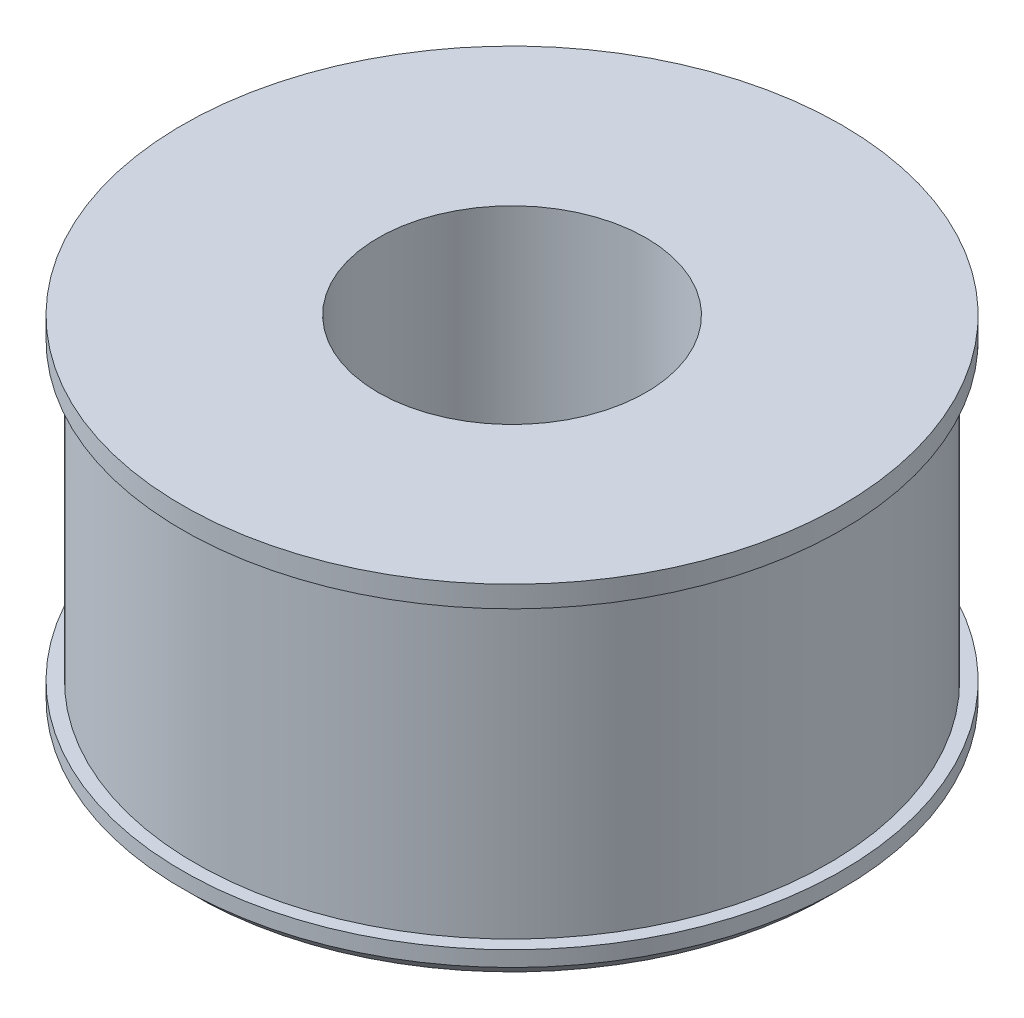
ISO-10303-21;
HEADER;
FILE_DESCRIPTION(('STEP AP214'),'2;1');
FILE_NAME('part.step','',(''),(''),'','','');
FILE_SCHEMA(('AUTOMOTIVE_DESIGN { 1 0 10303 214 1 1 1 1 }'));
ENDSEC;
DATA;
#1=APPLICATION_CONTEXT('core data for automotive mechanical design processes');
#2=APPLICATION_PROTOCOL_DEFINITION('international standard','automotive_design',2000,#1);
#3=PRODUCT_CONTEXT('',#1,'mechanical');
#4=PRODUCT('Part','Part','',(#3));
#5=PRODUCT_RELATED_PRODUCT_CATEGORY('part','',(#4));
#6=PRODUCT_DEFINITION_FORMATION('','',#4);
#7=PRODUCT_DEFINITION_CONTEXT('part definition',#1,'design');
#8=PRODUCT_DEFINITION('design','',#6,#7);
#9=PRODUCT_DEFINITION_SHAPE('','',#8);
#10=(LENGTH_UNIT() NAMED_UNIT(*) SI_UNIT(.MILLI.,.METRE.));
#11=(NAMED_UNIT(*) PLANE_ANGLE_UNIT() SI_UNIT($,.RADIAN.));
#12=(NAMED_UNIT(*) SI_UNIT($,.STERADIAN.) SOLID_ANGLE_UNIT());
#13=UNCERTAINTY_MEASURE_WITH_UNIT(LENGTH_MEASURE(1.E-05),#10,'distance_accuracy_value','');
#14=(GEOMETRIC_REPRESENTATION_CONTEXT(3) GLOBAL_UNCERTAINTY_ASSIGNED_CONTEXT((#13)) GLOBAL_UNIT_ASSIGNED_CONTEXT((#10,
#11,#12)) REPRESENTATION_CONTEXT('',''));
#15=CARTESIAN_POINT('',(0.,0.,0.));
#16=DIRECTION('',(0.,0.,1.));
#17=DIRECTION('',(1.,0.,0.));
#18=AXIS2_PLACEMENT_3D('',#15,#16,#17);
#19=CARTESIAN_POINT('',(0.,67.9541672598878,-133.507127196105));
#20=DIRECTION('',(0.,1.,0.));
#21=DIRECTION('',(0.,0.,1.));
#22=AXIS2_PLACEMENT_3D('',#19,#20,#21);
#23=PLANE('',#22);
#24=CARTESIAN_POINT('',(0.,67.9541672598878,0.));
#25=DIRECTION('',(0.,-1.,0.));
#26=DIRECTION('',(0.,0.,-1.));
#27=AXIS2_PLACEMENT_3D('',#24,#25,#26);
#28=CIRCLE('',#27,54.2672855149634);
#29=CARTESIAN_POINT('',(0.,67.9541672598878,-54.2672855149634));
#30=VERTEX_POINT('',#29);
#31=EDGE_CURVE('E69',#30,#30,#28,.T.);
#32=ORIENTED_EDGE('',*,*,#31,.T.);
#33=EDGE_LOOP('',(#32));
#34=FACE_BOUND('',#33,.T.);
#35=CARTESIAN_POINT('',(0.,67.9541672598878,0.));
#36=DIRECTION('',(0.,-1.,0.));
#37=DIRECTION('',(0.,0.,-1.));
#38=AXIS2_PLACEMENT_3D('',#35,#36,#37);
#39=CIRCLE('',#38,133.507127196105);
#40=CARTESIAN_POINT('',(0.,67.9541672598878,-133.507127196105));
#41=VERTEX_POINT('',#40);
#42=EDGE_CURVE('E64',#41,#41,#39,.T.);
#43=ORIENTED_EDGE('',*,*,#42,.F.);
#44=EDGE_LOOP('',(#43));
#45=FACE_BOUND('',#44,.T.);
#46=ADVANCED_FACE('F31',(#34,#45),#23,.T.);
#47=CARTESIAN_POINT('',(0.,-66.5134428656852,0.));
#48=DIRECTION('',(0.,-1.,0.));
#49=DIRECTION('',(0.,0.,-1.));
#50=AXIS2_PLACEMENT_3D('',#47,#48,#49);
#51=CYLINDRICAL_SURFACE('',#50,54.2672855149634);
#52=CARTESIAN_POINT('',(0.,-66.5134428656852,0.));
#53=DIRECTION('',(0.,-1.,0.));
#54=DIRECTION('',(0.,0.,-1.));
#55=AXIS2_PLACEMENT_3D('',#52,#53,#54);
#56=CIRCLE('',#55,54.2672855149634);
#57=CARTESIAN_POINT('',(0.,-66.5134428656852,-54.2672855149634));
#58=VERTEX_POINT('',#57);
#59=EDGE_CURVE('E44',#58,#58,#56,.T.);
#60=ORIENTED_EDGE('',*,*,#59,.T.);
#61=EDGE_LOOP('',(#60));
#62=FACE_BOUND('',#61,.T.);
#63=ORIENTED_EDGE('',*,*,#31,.F.);
#64=EDGE_LOOP('',(#63));
#65=FACE_BOUND('',#64,.T.);
#66=ADVANCED_FACE('F74',(#62,#65),#51,.F.);
#67=CARTESIAN_POINT('',(0.,-66.5134428656852,-54.2672855149634));
#68=DIRECTION('',(0.,-1.,0.));
#69=DIRECTION('',(0.,0.,-1.));
#70=AXIS2_PLACEMENT_3D('',#67,#68,#69);
#71=PLANE('',#70);
#72=CARTESIAN_POINT('',(0.,-66.5134428656852,0.));
#73=DIRECTION('',(0.,-1.,0.));
#74=DIRECTION('',(0.,0.,-1.));
#75=AXIS2_PLACEMENT_3D('',#72,#73,#74);
#76=CIRCLE('',#75,128.224471084029);
#77=CARTESIAN_POINT('',(0.,-66.5134428656852,-128.224471084029));
#78=VERTEX_POINT('',#77);
#79=EDGE_CURVE('E39',#78,#78,#76,.T.);
#80=ORIENTED_EDGE('',*,*,#79,.T.);
#81=EDGE_LOOP('',(#80));
#82=FACE_BOUND('',#81,.T.);
#83=ORIENTED_EDGE('',*,*,#59,.F.);
#84=EDGE_LOOP('',(#83));
#85=FACE_BOUND('',#84,.T.);
#86=ADVANCED_FACE('F77',(#82,#85),#71,.T.);
#87=CARTESIAN_POINT('',(0.,-66.5134428656852,0.));
#88=DIRECTION('',(0.,-1.,0.));
#89=DIRECTION('',(0.,0.,-1.));
#90=AXIS2_PLACEMENT_3D('',#87,#88,#89);
#91=CYLINDRICAL_SURFACE('',#90,133.507127196105);
#92=ORIENTED_EDGE('',*,*,#42,.T.);
#93=EDGE_LOOP('',(#92));
#94=FACE_BOUND('',#93,.T.);
#95=CARTESIAN_POINT('',(0.,59.3098208946724,0.));
#96=DIRECTION('',(0.,-1.,0.));
#97=DIRECTION('',(0.,0.,-1.));
#98=AXIS2_PLACEMENT_3D('',#95,#96,#97);
#99=CIRCLE('',#98,133.507127196105);
#100=CARTESIAN_POINT('',(0.,59.3098208946724,-133.507127196105));
#101=VERTEX_POINT('',#100);
#102=EDGE_CURVE('E59',#101,#101,#99,.T.);
#103=ORIENTED_EDGE('',*,*,#102,.F.);
#104=EDGE_LOOP('',(#103));
#105=FACE_BOUND('',#104,.T.);
#106=ADVANCED_FACE('F79',(#94,#105),#91,.T.);
#107=CARTESIAN_POINT('',(0.,59.3098208946724,-128.224471084029));
#108=DIRECTION('',(0.,-1.,0.));
#109=DIRECTION('',(0.,0.,-1.));
#110=AXIS2_PLACEMENT_3D('',#107,#108,#109);
#111=PLANE('',#110);
#112=ORIENTED_EDGE('',*,*,#102,.T.);
#113=EDGE_LOOP('',(#112));
#114=FACE_BOUND('',#113,.T.);
#115=CARTESIAN_POINT('',(0.,59.3098208946724,0.));
#116=DIRECTION('',(0.,-1.,0.));
#117=DIRECTION('',(0.,0.,-1.));
#118=AXIS2_PLACEMENT_3D('',#115,#116,#117);
#119=CIRCLE('',#118,128.224471084029);
#120=CARTESIAN_POINT('',(0.,59.3098208946724,-128.224471084029));
#121=VERTEX_POINT('',#120);
#122=EDGE_CURVE('E55',#121,#121,#119,.T.);
#123=ORIENTED_EDGE('',*,*,#122,.F.);
#124=EDGE_LOOP('',(#123));
#125=FACE_BOUND('',#124,.T.);
#126=ADVANCED_FACE('F86',(#114,#125),#111,.T.);
#127=CARTESIAN_POINT('',(0.,-66.5134428656852,0.));
#128=DIRECTION('',(0.,-1.,0.));
#129=DIRECTION('',(0.,0.,-1.));
#130=AXIS2_PLACEMENT_3D('',#127,#128,#129);
#131=CYLINDRICAL_SURFACE('',#130,128.224471084029);
#132=ORIENTED_EDGE('',*,*,#122,.T.);
#133=EDGE_LOOP('',(#132));
#134=FACE_BOUND('',#133,.T.);
#135=CARTESIAN_POINT('',(0.,-60.2703038241408,0.));
#136=DIRECTION('',(0.,-1.,0.));
#137=DIRECTION('',(0.,0.,-1.));
#138=AXIS2_PLACEMENT_3D('',#135,#136,#137);
#139=CIRCLE('',#138,128.224471084029);
#140=CARTESIAN_POINT('',(0.,-60.2703038241408,-128.224471084029));
#141=VERTEX_POINT('',#140);
#142=EDGE_CURVE('E10',#141,#141,#139,.F.);
#143=ORIENTED_EDGE('',*,*,#142,.T.);
#144=EDGE_LOOP('',(#143));
#145=FACE_BOUND('',#144,.T.);
#146=ADVANCED_FACE('F100',(#134,#145),#131,.T.);
#147=CARTESIAN_POINT('',(0.,-66.5134428656852,0.));
#148=DIRECTION('',(0.,1.,0.));
#149=DIRECTION('',(0.,0.,1.));
#150=AXIS2_PLACEMENT_3D('',#147,#148,#149);
#151=CONICAL_SURFACE('',#150,133.507127196105,0.785398163397422);
#152=CARTESIAN_POINT('',(0.,-71.7960989777615,0.));
#153=DIRECTION('',(0.,-1.,0.));
#154=DIRECTION('',(0.,0.,-1.));
#155=AXIS2_PLACEMENT_3D('',#152,#153,#154);
#156=CIRCLE('',#155,128.224471084029);
#157=CARTESIAN_POINT('',(0.,-71.7960989777615,-128.224471084029));
#158=VERTEX_POINT('',#157);
#159=EDGE_CURVE('E48',#158,#158,#156,.T.);
#160=ORIENTED_EDGE('',*,*,#159,.F.);
#161=EDGE_LOOP('',(#160));
#162=FACE_BOUND('',#161,.T.);
#163=CARTESIAN_POINT('',(0.,-66.5134428656852,0.));
#164=DIRECTION('',(0.,-1.,0.));
#165=DIRECTION('',(0.,0.,-1.));
#166=AXIS2_PLACEMENT_3D('',#163,#164,#165);
#167=CIRCLE('',#166,133.507127196105);
#168=CARTESIAN_POINT('',(0.,-66.5134428656852,-133.507127196105));
#169=VERTEX_POINT('',#168);
#170=EDGE_CURVE('E50',#169,#169,#167,.T.);
#171=ORIENTED_EDGE('',*,*,#170,.T.);
#172=EDGE_LOOP('',(#171));
#173=FACE_BOUND('',#172,.T.);
#174=ADVANCED_FACE('F103',(#162,#173),#151,.T.);
#175=CARTESIAN_POINT('',(0.,-66.5134428656852,0.));
#176=DIRECTION('',(0.,-1.,0.));
#177=DIRECTION('',(0.,0.,-1.));
#178=AXIS2_PLACEMENT_3D('',#175,#176,#177);
#179=CYLINDRICAL_SURFACE('',#178,128.224471084029);
#180=ORIENTED_EDGE('',*,*,#79,.F.);
#181=EDGE_LOOP('',(#180));
#182=FACE_BOUND('',#181,.T.);
#183=ORIENTED_EDGE('',*,*,#159,.T.);
#184=EDGE_LOOP('',(#183));
#185=FACE_BOUND('',#184,.T.);
#186=ADVANCED_FACE('F33',(#182,#185),#179,.F.);
#187=CARTESIAN_POINT('',(0.,-66.5134428656852,0.));
#188=DIRECTION('',(0.,-1.,0.));
#189=DIRECTION('',(0.,0.,-1.));
#190=AXIS2_PLACEMENT_3D('',#187,#188,#189);
#191=CYLINDRICAL_SURFACE('',#190,133.507127196105);
#192=ORIENTED_EDGE('',*,*,#170,.F.);
#193=EDGE_LOOP('',(#192));
#194=FACE_BOUND('',#193,.T.);
#195=CARTESIAN_POINT('',(0.,-60.2703038241408,0.));
#196=DIRECTION('',(0.,-1.,0.));
#197=DIRECTION('',(0.,0.,-1.));
#198=AXIS2_PLACEMENT_3D('',#195,#196,#197);
#199=CIRCLE('',#198,133.507127196105);
#200=CARTESIAN_POINT('',(0.,-60.2703038241408,-133.507127196105));
#201=VERTEX_POINT('',#200);
#202=EDGE_CURVE('E35',#201,#201,#199,.T.);
#203=ORIENTED_EDGE('',*,*,#202,.T.);
#204=EDGE_LOOP('',(#203));
#205=FACE_BOUND('',#204,.T.);
#206=ADVANCED_FACE('F108',(#194,#205),#191,.T.);
#207=CARTESIAN_POINT('',(0.,-60.2703038241408,-128.224471084029));
#208=DIRECTION('',(0.,-1.,0.));
#209=DIRECTION('',(0.,0.,-1.));
#210=AXIS2_PLACEMENT_3D('',#207,#208,#209);
#211=PLANE('',#210);
#212=ORIENTED_EDGE('',*,*,#202,.F.);
#213=EDGE_LOOP('',(#212));
#214=FACE_BOUND('',#213,.T.);
#215=ORIENTED_EDGE('',*,*,#142,.F.);
#216=EDGE_LOOP('',(#215));
#217=FACE_BOUND('',#216,.T.);
#218=ADVANCED_FACE('F111',(#214,#217),#211,.F.);
#219=CLOSED_SHELL('',(#46,#66,#86,#106,#126,#146,#174,#186,#206,#218));
#220=MANIFOLD_SOLID_BREP('B2',#219);
#221=ADVANCED_BREP_SHAPE_REPRESENTATION('',(#18,#220),#14);
#222=SHAPE_DEFINITION_REPRESENTATION(#9,#221);
ENDSEC;
END-ISO-10303-21;
